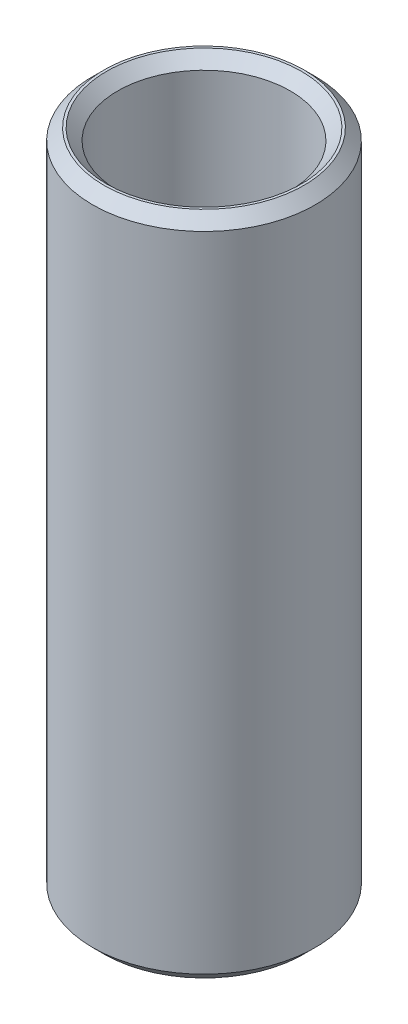
ISO-10303-21;
HEADER;
FILE_DESCRIPTION(('STEP AP214'),'2;1');
FILE_NAME('part.step','',(''),(''),'','','');
FILE_SCHEMA(('AUTOMOTIVE_DESIGN { 1 0 10303 214 1 1 1 1 }'));
ENDSEC;
DATA;
#1=APPLICATION_CONTEXT('core data for automotive mechanical design processes');
#2=APPLICATION_PROTOCOL_DEFINITION('international standard','automotive_design',2000,#1);
#3=PRODUCT_CONTEXT('',#1,'mechanical');
#4=PRODUCT('Part','Part','',(#3));
#5=PRODUCT_RELATED_PRODUCT_CATEGORY('part','',(#4));
#6=PRODUCT_DEFINITION_FORMATION('','',#4);
#7=PRODUCT_DEFINITION_CONTEXT('part definition',#1,'design');
#8=PRODUCT_DEFINITION('design','',#6,#7);
#9=PRODUCT_DEFINITION_SHAPE('','',#8);
#10=(LENGTH_UNIT() NAMED_UNIT(*) SI_UNIT(.MILLI.,.METRE.));
#11=(NAMED_UNIT(*) PLANE_ANGLE_UNIT() SI_UNIT($,.RADIAN.));
#12=(NAMED_UNIT(*) SI_UNIT($,.STERADIAN.) SOLID_ANGLE_UNIT());
#13=UNCERTAINTY_MEASURE_WITH_UNIT(LENGTH_MEASURE(1.E-05),#10,'distance_accuracy_value','');
#14=(GEOMETRIC_REPRESENTATION_CONTEXT(3) GLOBAL_UNCERTAINTY_ASSIGNED_CONTEXT((#13)) GLOBAL_UNIT_ASSIGNED_CONTEXT((#10,
#11,#12)) REPRESENTATION_CONTEXT('',''));
#15=CARTESIAN_POINT('',(0.,0.,0.));
#16=DIRECTION('',(0.,0.,1.));
#17=DIRECTION('',(1.,0.,0.));
#18=AXIS2_PLACEMENT_3D('',#15,#16,#17);
#19=CARTESIAN_POINT('',(0.,74.7827446405433,0.));
#20=DIRECTION('',(0.,-1.,0.));
#21=DIRECTION('',(0.,0.,-1.));
#22=AXIS2_PLACEMENT_3D('',#19,#20,#21);
#23=CYLINDRICAL_SURFACE('',#22,12.5);
#24=CARTESIAN_POINT('',(0.,1.26420934939009,0.));
#25=DIRECTION('',(0.,1.,0.));
#26=DIRECTION('',(0.,0.,1.));
#27=AXIS2_PLACEMENT_3D('',#24,#25,#26);
#28=CIRCLE('',#27,12.5);
#29=CARTESIAN_POINT('',(0.,1.26420934939009,12.5));
#30=VERTEX_POINT('',#29);
#31=EDGE_CURVE('E10',#30,#30,#28,.T.);
#32=ORIENTED_EDGE('',*,*,#31,.T.);
#33=EDGE_LOOP('',(#32));
#34=FACE_BOUND('',#33,.T.);
#35=CARTESIAN_POINT('',(0.,73.5185352911533,0.));
#36=DIRECTION('',(0.,1.,0.));
#37=DIRECTION('',(0.,0.,1.));
#38=AXIS2_PLACEMENT_3D('',#35,#36,#37);
#39=CIRCLE('',#38,12.5);
#40=CARTESIAN_POINT('',(0.,73.5185352911533,12.5));
#41=VERTEX_POINT('',#40);
#42=EDGE_CURVE('E50',#41,#41,#39,.F.);
#43=ORIENTED_EDGE('',*,*,#42,.T.);
#44=EDGE_LOOP('',(#43));
#45=FACE_BOUND('',#44,.T.);
#46=ADVANCED_FACE('F39',(#34,#45),#23,.T.);
#47=CARTESIAN_POINT('',(0.,74.7827446405433,0.));
#48=DIRECTION('',(0.,1.,0.));
#49=DIRECTION('',(0.,0.,1.));
#50=AXIS2_PLACEMENT_3D('',#47,#48,#49);
#51=PLANE('',#50);
#52=CARTESIAN_POINT('',(0.,74.7827446405433,0.));
#53=DIRECTION('',(0.,1.,0.));
#54=DIRECTION('',(0.,0.,1.));
#55=AXIS2_PLACEMENT_3D('',#52,#53,#54);
#56=CIRCLE('',#55,10.956476839615);
#57=CARTESIAN_POINT('',(0.,74.7827446405433,10.956476839615));
#58=VERTEX_POINT('',#57);
#59=EDGE_CURVE('E58',#58,#58,#56,.F.);
#60=ORIENTED_EDGE('',*,*,#59,.T.);
#61=EDGE_LOOP('',(#60));
#62=FACE_BOUND('',#61,.T.);
#63=CARTESIAN_POINT('',(0.,74.7827446405433,0.));
#64=DIRECTION('',(0.,1.,0.));
#65=DIRECTION('',(0.,0.,1.));
#66=AXIS2_PLACEMENT_3D('',#63,#64,#65);
#67=CIRCLE('',#66,11.23579065061);
#68=CARTESIAN_POINT('',(0.,74.7827446405433,11.23579065061));
#69=VERTEX_POINT('',#68);
#70=EDGE_CURVE('E61',#69,#69,#67,.T.);
#71=ORIENTED_EDGE('',*,*,#70,.T.);
#72=EDGE_LOOP('',(#71));
#73=FACE_BOUND('',#72,.T.);
#74=ADVANCED_FACE('F88',(#62,#73),#51,.T.);
#75=CARTESIAN_POINT('',(0.,0.,0.));
#76=DIRECTION('',(0.,1.,0.));
#77=DIRECTION('',(0.,0.,1.));
#78=AXIS2_PLACEMENT_3D('',#75,#76,#77);
#79=PLANE('',#78);
#80=CARTESIAN_POINT('',(0.,0.,0.));
#81=DIRECTION('',(0.,1.,0.));
#82=DIRECTION('',(0.,0.,1.));
#83=AXIS2_PLACEMENT_3D('',#80,#81,#82);
#84=CIRCLE('',#83,10.956476839615);
#85=CARTESIAN_POINT('',(0.,0.,10.956476839615));
#86=VERTEX_POINT('',#85);
#87=EDGE_CURVE('E51',#86,#86,#84,.T.);
#88=ORIENTED_EDGE('',*,*,#87,.T.);
#89=EDGE_LOOP('',(#88));
#90=FACE_BOUND('',#89,.T.);
#91=CARTESIAN_POINT('',(0.,0.,0.));
#92=DIRECTION('',(0.,1.,0.));
#93=DIRECTION('',(0.,0.,1.));
#94=AXIS2_PLACEMENT_3D('',#91,#92,#93);
#95=CIRCLE('',#94,11.2357906506099);
#96=CARTESIAN_POINT('',(0.,0.,11.2357906506099));
#97=VERTEX_POINT('',#96);
#98=EDGE_CURVE('E54',#97,#97,#95,.F.);
#99=ORIENTED_EDGE('',*,*,#98,.T.);
#100=EDGE_LOOP('',(#99));
#101=FACE_BOUND('',#100,.T.);
#102=ADVANCED_FACE('F83',(#90,#101),#79,.F.);
#103=CARTESIAN_POINT('',(0.,74.7827446405433,0.));
#104=DIRECTION('',(0.,-1.,0.));
#105=DIRECTION('',(0.,0.,-1.));
#106=AXIS2_PLACEMENT_3D('',#103,#104,#105);
#107=CYLINDRICAL_SURFACE('',#106,9.69226749022497);
#108=CARTESIAN_POINT('',(0.,73.5185352911533,0.));
#109=DIRECTION('',(0.,1.,0.));
#110=DIRECTION('',(0.,0.,1.));
#111=AXIS2_PLACEMENT_3D('',#108,#109,#110);
#112=CIRCLE('',#111,9.69226749022497);
#113=CARTESIAN_POINT('',(0.,73.5185352911533,9.69226749022497));
#114=VERTEX_POINT('',#113);
#115=EDGE_CURVE('E67',#114,#114,#112,.T.);
#116=ORIENTED_EDGE('',*,*,#115,.T.);
#117=EDGE_LOOP('',(#116));
#118=FACE_BOUND('',#117,.T.);
#119=CARTESIAN_POINT('',(0.,1.26420934939006,0.));
#120=DIRECTION('',(0.,1.,0.));
#121=DIRECTION('',(0.,0.,1.));
#122=AXIS2_PLACEMENT_3D('',#119,#120,#121);
#123=CIRCLE('',#122,9.69226749022497);
#124=CARTESIAN_POINT('',(0.,1.26420934939006,9.69226749022497));
#125=VERTEX_POINT('',#124);
#126=EDGE_CURVE('E69',#125,#125,#123,.F.);
#127=ORIENTED_EDGE('',*,*,#126,.T.);
#128=EDGE_LOOP('',(#127));
#129=FACE_BOUND('',#128,.T.);
#130=ADVANCED_FACE('F71',(#118,#129),#107,.F.);
#131=CARTESIAN_POINT('',(0.,73.5185352911533,0.));
#132=DIRECTION('',(0.,1.,0.));
#133=DIRECTION('',(0.,0.,1.));
#134=AXIS2_PLACEMENT_3D('',#131,#132,#133);
#135=CONICAL_SURFACE('',#134,9.69226749022497,0.785398163397451);
#136=ORIENTED_EDGE('',*,*,#59,.F.);
#137=EDGE_LOOP('',(#136));
#138=FACE_BOUND('',#137,.T.);
#139=ORIENTED_EDGE('',*,*,#115,.F.);
#140=EDGE_LOOP('',(#139));
#141=FACE_BOUND('',#140,.T.);
#142=ADVANCED_FACE('F77',(#138,#141),#135,.F.);
#143=CARTESIAN_POINT('',(0.,0.,0.));
#144=DIRECTION('',(0.,-1.,0.));
#145=DIRECTION('',(0.,0.,-1.));
#146=AXIS2_PLACEMENT_3D('',#143,#144,#145);
#147=CONICAL_SURFACE('',#146,10.956476839615,0.785398163397446);
#148=ORIENTED_EDGE('',*,*,#126,.F.);
#149=EDGE_LOOP('',(#148));
#150=FACE_BOUND('',#149,.T.);
#151=ORIENTED_EDGE('',*,*,#87,.F.);
#152=EDGE_LOOP('',(#151));
#153=FACE_BOUND('',#152,.T.);
#154=ADVANCED_FACE('F73',(#150,#153),#147,.F.);
#155=CARTESIAN_POINT('',(0.,1.26420934939009,0.));
#156=DIRECTION('',(0.,1.,0.));
#157=DIRECTION('',(0.,0.,1.));
#158=AXIS2_PLACEMENT_3D('',#155,#156,#157);
#159=CONICAL_SURFACE('',#158,12.5,0.785398163397449);
#160=ORIENTED_EDGE('',*,*,#98,.F.);
#161=EDGE_LOOP('',(#160));
#162=FACE_BOUND('',#161,.T.);
#163=ORIENTED_EDGE('',*,*,#31,.F.);
#164=EDGE_LOOP('',(#163));
#165=FACE_BOUND('',#164,.T.);
#166=ADVANCED_FACE('F76',(#162,#165),#159,.T.);
#167=CARTESIAN_POINT('',(0.,74.7827446405433,0.));
#168=DIRECTION('',(0.,-1.,0.));
#169=DIRECTION('',(0.,0.,-1.));
#170=AXIS2_PLACEMENT_3D('',#167,#168,#169);
#171=CONICAL_SURFACE('',#170,11.23579065061,0.785398163397444);
#172=ORIENTED_EDGE('',*,*,#42,.F.);
#173=EDGE_LOOP('',(#172));
#174=FACE_BOUND('',#173,.T.);
#175=ORIENTED_EDGE('',*,*,#70,.F.);
#176=EDGE_LOOP('',(#175));
#177=FACE_BOUND('',#176,.T.);
#178=ADVANCED_FACE('F45',(#174,#177),#171,.T.);
#179=CLOSED_SHELL('',(#46,#74,#102,#130,#142,#154,#166,#178));
#180=MANIFOLD_SOLID_BREP('B2',#179);
#181=ADVANCED_BREP_SHAPE_REPRESENTATION('',(#18,#180),#14);
#182=SHAPE_DEFINITION_REPRESENTATION(#9,#181);
ENDSEC;
END-ISO-10303-21;
